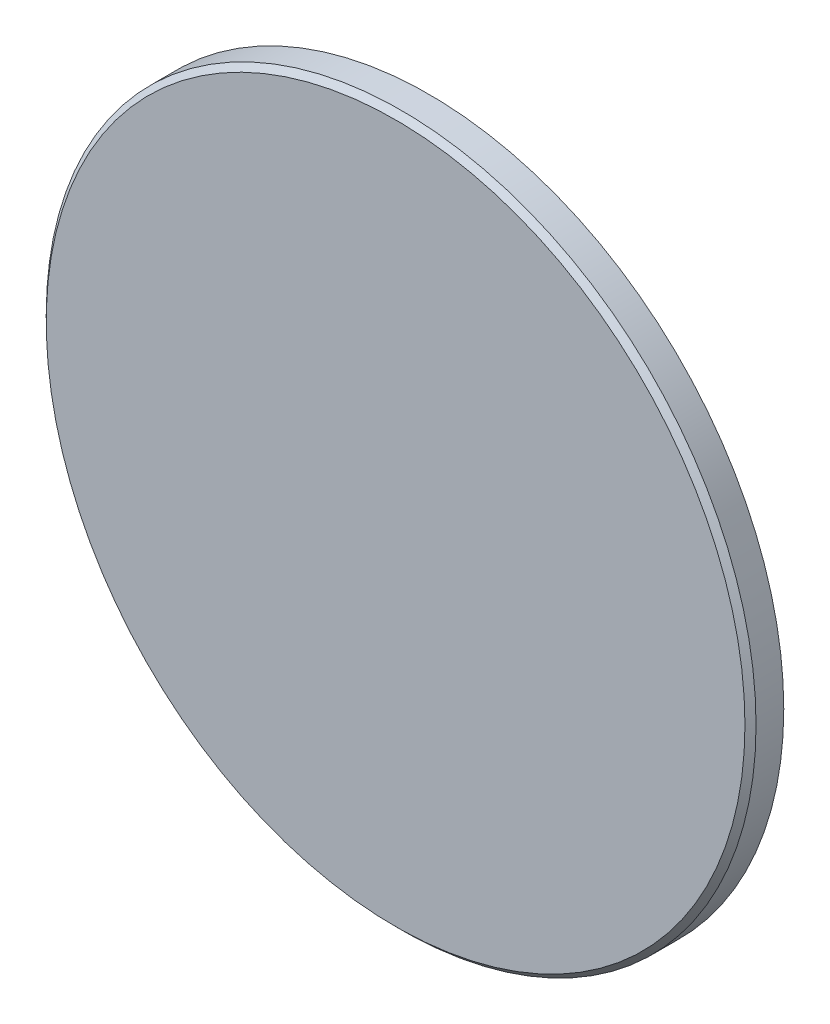
ISO-10303-21;
HEADER;
FILE_DESCRIPTION(('STEP AP214'),'2;1');
FILE_NAME('part.step','',(''),(''),'','','');
FILE_SCHEMA(('AUTOMOTIVE_DESIGN { 1 0 10303 214 1 1 1 1 }'));
ENDSEC;
DATA;
#1=APPLICATION_CONTEXT('core data for automotive mechanical design processes');
#2=APPLICATION_PROTOCOL_DEFINITION('international standard','automotive_design',2000,#1);
#3=PRODUCT_CONTEXT('',#1,'mechanical');
#4=PRODUCT('Part','Part','',(#3));
#5=PRODUCT_RELATED_PRODUCT_CATEGORY('part','',(#4));
#6=PRODUCT_DEFINITION_FORMATION('','',#4);
#7=PRODUCT_DEFINITION_CONTEXT('part definition',#1,'design');
#8=PRODUCT_DEFINITION('design','',#6,#7);
#9=PRODUCT_DEFINITION_SHAPE('','',#8);
#10=(LENGTH_UNIT() NAMED_UNIT(*) SI_UNIT(.MILLI.,.METRE.));
#11=(NAMED_UNIT(*) PLANE_ANGLE_UNIT() SI_UNIT($,.RADIAN.));
#12=(NAMED_UNIT(*) SI_UNIT($,.STERADIAN.) SOLID_ANGLE_UNIT());
#13=UNCERTAINTY_MEASURE_WITH_UNIT(LENGTH_MEASURE(1.E-05),#10,'distance_accuracy_value','');
#14=(GEOMETRIC_REPRESENTATION_CONTEXT(3) GLOBAL_UNCERTAINTY_ASSIGNED_CONTEXT((#13)) GLOBAL_UNIT_ASSIGNED_CONTEXT((#10,
#11,#12)) REPRESENTATION_CONTEXT('',''));
#15=CARTESIAN_POINT('',(0.,0.,0.));
#16=DIRECTION('',(0.,0.,1.));
#17=DIRECTION('',(1.,0.,0.));
#18=AXIS2_PLACEMENT_3D('',#15,#16,#17);
#19=CARTESIAN_POINT('',(0.,0.,1.5));
#20=DIRECTION('',(0.,0.,-1.));
#21=DIRECTION('',(-1.,0.,0.));
#22=AXIS2_PLACEMENT_3D('',#19,#20,#21);
#23=CYLINDRICAL_SURFACE('',#22,16.);
#24=CARTESIAN_POINT('',(0.,0.,1.25000000000001));
#25=DIRECTION('',(0.,0.,1.));
#26=DIRECTION('',(1.,0.,0.));
#27=AXIS2_PLACEMENT_3D('',#24,#25,#26);
#28=CIRCLE('',#27,16.);
#29=CARTESIAN_POINT('',(16.,0.,1.25000000000001));
#30=VERTEX_POINT('',#29);
#31=EDGE_CURVE('E10',#30,#30,#28,.F.);
#32=ORIENTED_EDGE('',*,*,#31,.T.);
#33=EDGE_LOOP('',(#32));
#34=FACE_BOUND('',#33,.T.);
#35=CARTESIAN_POINT('',(0.,0.,0.));
#36=DIRECTION('',(0.,0.,1.));
#37=DIRECTION('',(1.,0.,0.));
#38=AXIS2_PLACEMENT_3D('',#35,#36,#37);
#39=CIRCLE('',#38,16.);
#40=CARTESIAN_POINT('',(16.,0.,0.));
#41=VERTEX_POINT('',#40);
#42=EDGE_CURVE('E42',#41,#41,#39,.T.);
#43=ORIENTED_EDGE('',*,*,#42,.T.);
#44=EDGE_LOOP('',(#43));
#45=FACE_BOUND('',#44,.T.);
#46=ADVANCED_FACE('F31',(#34,#45),#23,.T.);
#47=CARTESIAN_POINT('',(0.,0.,1.5));
#48=DIRECTION('',(0.,0.,1.));
#49=DIRECTION('',(1.,0.,0.));
#50=AXIS2_PLACEMENT_3D('',#47,#48,#49);
#51=PLANE('',#50);
#52=CARTESIAN_POINT('',(0.,0.,1.5));
#53=DIRECTION('',(0.,0.,1.));
#54=DIRECTION('',(1.,0.,0.));
#55=AXIS2_PLACEMENT_3D('',#52,#53,#54);
#56=CIRCLE('',#55,15.75);
#57=CARTESIAN_POINT('',(15.75,0.,1.5));
#58=VERTEX_POINT('',#57);
#59=EDGE_CURVE('E38',#58,#58,#56,.T.);
#60=ORIENTED_EDGE('',*,*,#59,.T.);
#61=EDGE_LOOP('',(#60));
#62=FACE_BOUND('',#61,.T.);
#63=ADVANCED_FACE('F52',(#62),#51,.T.);
#64=CARTESIAN_POINT('',(0.,0.,0.));
#65=DIRECTION('',(0.,0.,1.));
#66=DIRECTION('',(1.,0.,0.));
#67=AXIS2_PLACEMENT_3D('',#64,#65,#66);
#68=PLANE('',#67);
#69=ORIENTED_EDGE('',*,*,#42,.F.);
#70=EDGE_LOOP('',(#69));
#71=FACE_BOUND('',#70,.T.);
#72=ADVANCED_FACE('F50',(#71),#68,.F.);
#73=CARTESIAN_POINT('',(0.,0.,1.5));
#74=DIRECTION('',(0.,0.,-1.));
#75=DIRECTION('',(-1.,0.,0.));
#76=AXIS2_PLACEMENT_3D('',#73,#74,#75);
#77=CONICAL_SURFACE('',#76,15.75,0.785398163397448);
#78=ORIENTED_EDGE('',*,*,#31,.F.);
#79=EDGE_LOOP('',(#78));
#80=FACE_BOUND('',#79,.T.);
#81=ORIENTED_EDGE('',*,*,#59,.F.);
#82=EDGE_LOOP('',(#81));
#83=FACE_BOUND('',#82,.T.);
#84=ADVANCED_FACE('F33',(#80,#83),#77,.T.);
#85=CLOSED_SHELL('',(#46,#63,#72,#84));
#86=MANIFOLD_SOLID_BREP('B2',#85);
#87=ADVANCED_BREP_SHAPE_REPRESENTATION('',(#18,#86),#14);
#88=SHAPE_DEFINITION_REPRESENTATION(#9,#87);
ENDSEC;
END-ISO-10303-21;
